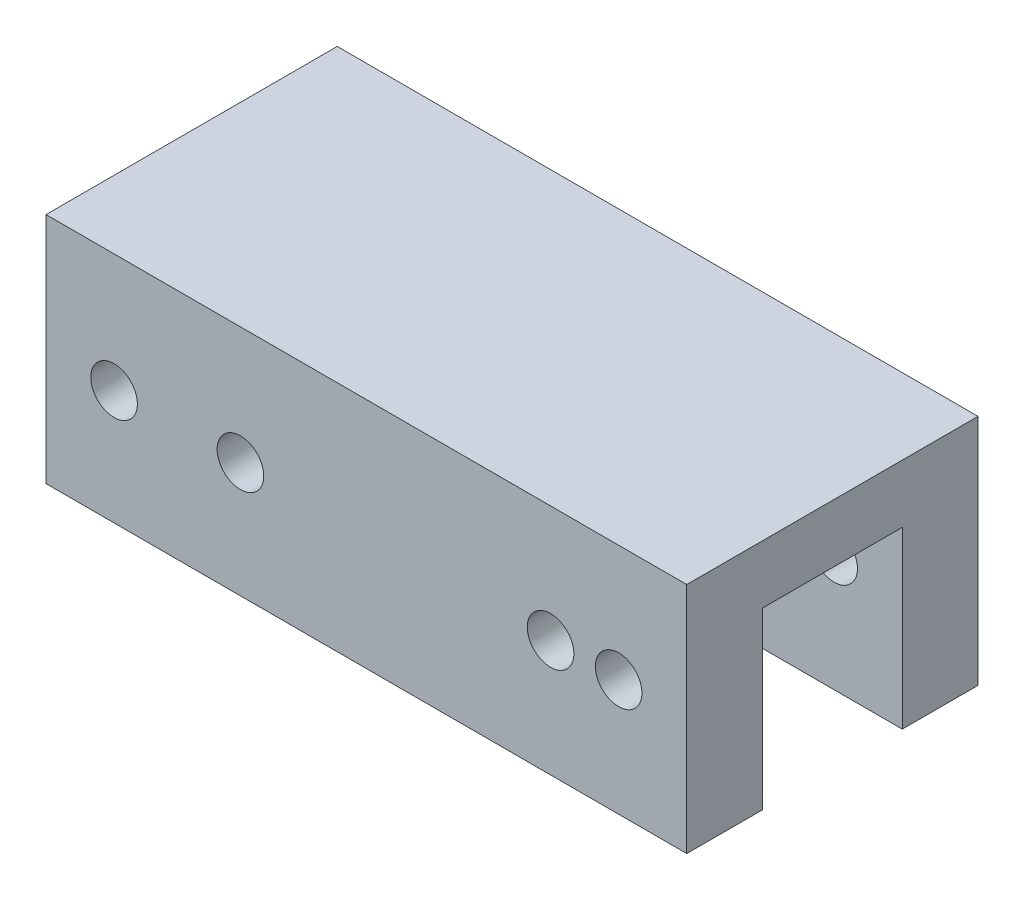
ISO-10303-21;
HEADER;
FILE_DESCRIPTION(('STEP AP214'),'2;1');
FILE_NAME('part.step','',(''),(''),'','','');
FILE_SCHEMA(('AUTOMOTIVE_DESIGN { 1 0 10303 214 1 1 1 1 }'));
ENDSEC;
DATA;
#1=APPLICATION_CONTEXT('core data for automotive mechanical design processes');
#2=APPLICATION_PROTOCOL_DEFINITION('international standard','automotive_design',2000,#1);
#3=PRODUCT_CONTEXT('',#1,'mechanical');
#4=PRODUCT('Part','Part','',(#3));
#5=PRODUCT_RELATED_PRODUCT_CATEGORY('part','',(#4));
#6=PRODUCT_DEFINITION_FORMATION('','',#4);
#7=PRODUCT_DEFINITION_CONTEXT('part definition',#1,'design');
#8=PRODUCT_DEFINITION('design','',#6,#7);
#9=PRODUCT_DEFINITION_SHAPE('','',#8);
#10=(LENGTH_UNIT() NAMED_UNIT(*) SI_UNIT(.MILLI.,.METRE.));
#11=(NAMED_UNIT(*) PLANE_ANGLE_UNIT() SI_UNIT($,.RADIAN.));
#12=(NAMED_UNIT(*) SI_UNIT($,.STERADIAN.) SOLID_ANGLE_UNIT());
#13=UNCERTAINTY_MEASURE_WITH_UNIT(LENGTH_MEASURE(1.E-05),#10,'distance_accuracy_value','');
#14=(GEOMETRIC_REPRESENTATION_CONTEXT(3) GLOBAL_UNCERTAINTY_ASSIGNED_CONTEXT((#13)) GLOBAL_UNIT_ASSIGNED_CONTEXT((#10,
#11,#12)) REPRESENTATION_CONTEXT('',''));
#15=CARTESIAN_POINT('',(0.,0.,0.));
#16=DIRECTION('',(0.,0.,1.));
#17=DIRECTION('',(1.,0.,0.));
#18=AXIS2_PLACEMENT_3D('',#15,#16,#17);
#19=CARTESIAN_POINT('',(0.,0.,0.));
#20=DIRECTION('',(0.,1.,0.));
#21=DIRECTION('',(0.,0.,1.));
#22=AXIS2_PLACEMENT_3D('',#19,#20,#21);
#23=PLANE('',#22);
#24=DIRECTION('',(0.,0.,1.));
#25=VECTOR('',#24,1.);
#26=CARTESIAN_POINT('',(-24.7741935483871,0.,8.51612903225807));
#27=LINE('',#26,#25);
#28=CARTESIAN_POINT('',(-24.7741935483871,0.,2.01612903225807));
#29=VERTEX_POINT('',#28);
#30=CARTESIAN_POINT('',(-24.7741935483871,0.,8.51612903225807));
#31=VERTEX_POINT('',#30);
#32=EDGE_CURVE('E159',#29,#31,#27,.T.);
#33=ORIENTED_EDGE('',*,*,#32,.F.);
#34=DIRECTION('',(-1.,0.,0.));
#35=VECTOR('',#34,1.);
#36=CARTESIAN_POINT('',(30.2258064516129,0.,2.01612903225807));
#37=LINE('',#36,#35);
#38=CARTESIAN_POINT('',(30.2258064516129,0.,2.01612903225807));
#39=VERTEX_POINT('',#38);
#40=EDGE_CURVE('E114',#39,#29,#37,.T.);
#41=ORIENTED_EDGE('',*,*,#40,.F.);
#42=DIRECTION('',(0.,0.,-1.));
#43=VECTOR('',#42,1.);
#44=CARTESIAN_POINT('',(30.2258064516129,0.,8.51612903225806));
#45=LINE('',#44,#43);
#46=CARTESIAN_POINT('',(30.2258064516129,0.,8.51612903225806));
#47=VERTEX_POINT('',#46);
#48=EDGE_CURVE('E154',#47,#39,#45,.T.);
#49=ORIENTED_EDGE('',*,*,#48,.F.);
#50=DIRECTION('',(1.,0.,0.));
#51=VECTOR('',#50,1.);
#52=CARTESIAN_POINT('',(30.2258064516129,0.,8.51612903225806));
#53=LINE('',#52,#51);
#54=EDGE_CURVE('E80',#31,#47,#53,.T.);
#55=ORIENTED_EDGE('',*,*,#54,.F.);
#56=EDGE_LOOP('',(#33,#41,#49,#55));
#57=FACE_BOUND('',#56,.T.);
#58=ADVANCED_FACE('F33',(#57),#23,.F.);
#59=CARTESIAN_POINT('',(30.2258064516129,20.,8.51612903225806));
#60=DIRECTION('',(-1.,0.,0.));
#61=DIRECTION('',(0.,0.,1.));
#62=AXIS2_PLACEMENT_3D('',#59,#60,#61);
#63=PLANE('',#62);
#64=ORIENTED_EDGE('',*,*,#48,.T.);
#65=DIRECTION('',(0.,-1.,0.));
#66=VECTOR('',#65,1.);
#67=CARTESIAN_POINT('',(30.2258064516129,15.,2.01612903225807));
#68=LINE('',#67,#66);
#69=CARTESIAN_POINT('',(30.2258064516129,15.,2.01612903225807));
#70=VERTEX_POINT('',#69);
#71=EDGE_CURVE('E140',#70,#39,#68,.T.);
#72=ORIENTED_EDGE('',*,*,#71,.F.);
#73=DIRECTION('',(0.,0.,1.));
#74=VECTOR('',#73,1.);
#75=CARTESIAN_POINT('',(30.2258064516129,15.,-9.98387096774193));
#76=LINE('',#75,#74);
#77=CARTESIAN_POINT('',(30.2258064516129,15.,-9.98387096774193));
#78=VERTEX_POINT('',#77);
#79=EDGE_CURVE('E118',#78,#70,#76,.T.);
#80=ORIENTED_EDGE('',*,*,#79,.F.);
#81=DIRECTION('',(0.,-1.,0.));
#82=VECTOR('',#81,1.);
#83=CARTESIAN_POINT('',(30.2258064516129,15.,-9.98387096774193));
#84=LINE('',#83,#82);
#85=CARTESIAN_POINT('',(30.2258064516129,0.,-9.98387096774193));
#86=VERTEX_POINT('',#85);
#87=EDGE_CURVE('E143',#78,#86,#84,.T.);
#88=ORIENTED_EDGE('',*,*,#87,.T.);
#89=CARTESIAN_POINT('',(30.2258064516129,0.,-16.4838709677419));
#90=VERTEX_POINT('',#89);
#91=EDGE_CURVE('E142',#86,#90,#45,.T.);
#92=ORIENTED_EDGE('',*,*,#91,.T.);
#93=DIRECTION('',(0.,-1.,0.));
#94=VECTOR('',#93,1.);
#95=CARTESIAN_POINT('',(30.2258064516129,20.,-16.4838709677419));
#96=LINE('',#95,#94);
#97=CARTESIAN_POINT('',(30.2258064516129,20.,-16.4838709677419));
#98=VERTEX_POINT('',#97);
#99=EDGE_CURVE('E11',#98,#90,#96,.T.);
#100=ORIENTED_EDGE('',*,*,#99,.F.);
#101=DIRECTION('',(0.,0.,-1.));
#102=VECTOR('',#101,1.);
#103=CARTESIAN_POINT('',(30.2258064516129,20.,8.51612903225806));
#104=LINE('',#103,#102);
#105=CARTESIAN_POINT('',(30.2258064516129,20.,8.51612903225806));
#106=VERTEX_POINT('',#105);
#107=EDGE_CURVE('E147',#106,#98,#104,.T.);
#108=ORIENTED_EDGE('',*,*,#107,.F.);
#109=DIRECTION('',(0.,-1.,0.));
#110=VECTOR('',#109,1.);
#111=CARTESIAN_POINT('',(30.2258064516129,20.,8.51612903225806));
#112=LINE('',#111,#110);
#113=EDGE_CURVE('E153',#106,#47,#112,.T.);
#114=ORIENTED_EDGE('',*,*,#113,.T.);
#115=EDGE_LOOP('',(#64,#72,#80,#88,#92,#100,#108,#114));
#116=FACE_BOUND('',#115,.T.);
#117=ADVANCED_FACE('F35',(#116),#63,.F.);
#118=CARTESIAN_POINT('',(30.2258064516129,20.,-16.4838709677419));
#119=DIRECTION('',(0.,0.,1.));
#120=DIRECTION('',(1.,0.,0.));
#121=AXIS2_PLACEMENT_3D('',#118,#119,#120);
#122=PLANE('',#121);
#123=CARTESIAN_POINT('',(-18.9291935483871,9.83881896170148,-16.4838709677419));
#124=DIRECTION('',(0.,0.,-1.));
#125=DIRECTION('',(-1.,0.,0.));
#126=AXIS2_PLACEMENT_3D('',#123,#124,#125);
#127=CIRCLE('',#126,2.);
#128=CARTESIAN_POINT('',(-20.9291935483871,9.83881896170148,-16.4838709677419));
#129=VERTEX_POINT('',#128);
#130=EDGE_CURVE('E316',#129,#129,#127,.T.);
#131=ORIENTED_EDGE('',*,*,#130,.F.);
#132=EDGE_LOOP('',(#131));
#133=FACE_BOUND('',#132,.T.);
#134=CARTESIAN_POINT('',(-8.08419354838709,9.90361755901248,-16.4838709677419));
#135=DIRECTION('',(0.,0.,-1.));
#136=DIRECTION('',(-1.,0.,0.));
#137=AXIS2_PLACEMENT_3D('',#134,#135,#136);
#138=CIRCLE('',#137,2.);
#139=CARTESIAN_POINT('',(-10.0841935483871,9.90361755901248,-16.4838709677419));
#140=VERTEX_POINT('',#139);
#141=EDGE_CURVE('E180',#140,#140,#138,.T.);
#142=ORIENTED_EDGE('',*,*,#141,.F.);
#143=EDGE_LOOP('',(#142));
#144=FACE_BOUND('',#143,.T.);
#145=CARTESIAN_POINT('',(18.5358064516129,10.,-16.4838709677419));
#146=DIRECTION('',(0.,0.,1.));
#147=DIRECTION('',(1.,0.,0.));
#148=AXIS2_PLACEMENT_3D('',#145,#146,#147);
#149=CIRCLE('',#148,2.);
#150=CARTESIAN_POINT('',(20.5358064516129,10.,-16.4838709677419));
#151=VERTEX_POINT('',#150);
#152=EDGE_CURVE('E202',#151,#151,#149,.T.);
#153=ORIENTED_EDGE('',*,*,#152,.T.);
#154=EDGE_LOOP('',(#153));
#155=FACE_BOUND('',#154,.T.);
#156=CARTESIAN_POINT('',(24.3808064516129,10.,-16.4838709677419));
#157=DIRECTION('',(0.,0.,1.));
#158=DIRECTION('',(1.,0.,0.));
#159=AXIS2_PLACEMENT_3D('',#156,#157,#158);
#160=CIRCLE('',#159,2.);
#161=CARTESIAN_POINT('',(26.3808064516129,10.,-16.4838709677419));
#162=VERTEX_POINT('',#161);
#163=EDGE_CURVE('E138',#162,#162,#160,.T.);
#164=ORIENTED_EDGE('',*,*,#163,.T.);
#165=EDGE_LOOP('',(#164));
#166=FACE_BOUND('',#165,.T.);
#167=DIRECTION('',(-1.,0.,0.));
#168=VECTOR('',#167,1.);
#169=CARTESIAN_POINT('',(30.2258064516129,0.,-16.4838709677419));
#170=LINE('',#169,#168);
#171=CARTESIAN_POINT('',(-24.7741935483871,0.,-16.4838709677419));
#172=VERTEX_POINT('',#171);
#173=EDGE_CURVE('E157',#90,#172,#170,.T.);
#174=ORIENTED_EDGE('',*,*,#173,.T.);
#175=DIRECTION('',(0.,-1.,0.));
#176=VECTOR('',#175,1.);
#177=CARTESIAN_POINT('',(-24.7741935483871,20.,-16.4838709677419));
#178=LINE('',#177,#176);
#179=CARTESIAN_POINT('',(-24.7741935483871,20.,-16.4838709677419));
#180=VERTEX_POINT('',#179);
#181=EDGE_CURVE('E42',#180,#172,#178,.T.);
#182=ORIENTED_EDGE('',*,*,#181,.F.);
#183=DIRECTION('',(-1.,0.,0.));
#184=VECTOR('',#183,1.);
#185=CARTESIAN_POINT('',(30.2258064516129,20.,-16.4838709677419));
#186=LINE('',#185,#184);
#187=EDGE_CURVE('E87',#98,#180,#186,.T.);
#188=ORIENTED_EDGE('',*,*,#187,.F.);
#189=ORIENTED_EDGE('',*,*,#99,.T.);
#190=EDGE_LOOP('',(#174,#182,#188,#189));
#191=FACE_BOUND('',#190,.T.);
#192=ADVANCED_FACE('F211',(#133,#144,#155,#166,#191),#122,.F.);
#193=CARTESIAN_POINT('',(-24.7741935483871,20.,8.51612903225807));
#194=DIRECTION('',(1.,0.,0.));
#195=DIRECTION('',(0.,0.,-1.));
#196=AXIS2_PLACEMENT_3D('',#193,#194,#195);
#197=PLANE('',#196);
#198=DIRECTION('',(0.,0.,-1.));
#199=VECTOR('',#198,1.);
#200=CARTESIAN_POINT('',(-24.7741935483871,15.,2.01612903225807));
#201=LINE('',#200,#199);
#202=CARTESIAN_POINT('',(-24.7741935483871,15.,2.01612903225807));
#203=VERTEX_POINT('',#202);
#204=CARTESIAN_POINT('',(-24.7741935483871,15.,-9.98387096774194));
#205=VERTEX_POINT('',#204);
#206=EDGE_CURVE('E124',#203,#205,#201,.T.);
#207=ORIENTED_EDGE('',*,*,#206,.F.);
#208=DIRECTION('',(0.,-1.,0.));
#209=VECTOR('',#208,1.);
#210=CARTESIAN_POINT('',(-24.7741935483871,15.,2.01612903225807));
#211=LINE('',#210,#209);
#212=EDGE_CURVE('E108',#203,#29,#211,.T.);
#213=ORIENTED_EDGE('',*,*,#212,.T.);
#214=ORIENTED_EDGE('',*,*,#32,.T.);
#215=DIRECTION('',(0.,-1.,0.));
#216=VECTOR('',#215,1.);
#217=CARTESIAN_POINT('',(-24.7741935483871,20.,8.51612903225807));
#218=LINE('',#217,#216);
#219=CARTESIAN_POINT('',(-24.7741935483871,20.,8.51612903225807));
#220=VERTEX_POINT('',#219);
#221=EDGE_CURVE('E164',#220,#31,#218,.T.);
#222=ORIENTED_EDGE('',*,*,#221,.F.);
#223=DIRECTION('',(0.,0.,1.));
#224=VECTOR('',#223,1.);
#225=CARTESIAN_POINT('',(-24.7741935483871,20.,8.51612903225807));
#226=LINE('',#225,#224);
#227=EDGE_CURVE('E150',#180,#220,#226,.T.);
#228=ORIENTED_EDGE('',*,*,#227,.F.);
#229=ORIENTED_EDGE('',*,*,#181,.T.);
#230=CARTESIAN_POINT('',(-24.7741935483871,0.,-9.98387096774194));
#231=VERTEX_POINT('',#230);
#232=EDGE_CURVE('E160',#172,#231,#27,.T.);
#233=ORIENTED_EDGE('',*,*,#232,.T.);
#234=DIRECTION('',(0.,-1.,0.));
#235=VECTOR('',#234,1.);
#236=CARTESIAN_POINT('',(-24.7741935483871,15.,-9.98387096774194));
#237=LINE('',#236,#235);
#238=EDGE_CURVE('E50',#205,#231,#237,.T.);
#239=ORIENTED_EDGE('',*,*,#238,.F.);
#240=EDGE_LOOP('',(#207,#213,#214,#222,#228,#229,#233,#239));
#241=FACE_BOUND('',#240,.T.);
#242=ADVANCED_FACE('F129',(#241),#197,.F.);
#243=CARTESIAN_POINT('',(30.2258064516129,20.,8.51612903225806));
#244=DIRECTION('',(0.,0.,-1.));
#245=DIRECTION('',(-1.,0.,0.));
#246=AXIS2_PLACEMENT_3D('',#243,#244,#245);
#247=PLANE('',#246);
#248=CARTESIAN_POINT('',(-18.9291935483871,9.83881896170148,8.51612903225807));
#249=DIRECTION('',(0.,0.,-1.));
#250=DIRECTION('',(-1.,0.,0.));
#251=AXIS2_PLACEMENT_3D('',#248,#249,#250);
#252=CIRCLE('',#251,2.);
#253=CARTESIAN_POINT('',(-20.9291935483871,9.83881896170148,8.51612903225807));
#254=VERTEX_POINT('',#253);
#255=EDGE_CURVE('E187',#254,#254,#252,.T.);
#256=ORIENTED_EDGE('',*,*,#255,.T.);
#257=EDGE_LOOP('',(#256));
#258=FACE_BOUND('',#257,.T.);
#259=CARTESIAN_POINT('',(-8.08419354838709,9.90361755901248,8.51612903225806));
#260=DIRECTION('',(0.,0.,-1.));
#261=DIRECTION('',(-1.,0.,0.));
#262=AXIS2_PLACEMENT_3D('',#259,#260,#261);
#263=CIRCLE('',#262,2.);
#264=CARTESIAN_POINT('',(-10.0841935483871,9.90361755901248,8.51612903225806));
#265=VERTEX_POINT('',#264);
#266=EDGE_CURVE('E184',#265,#265,#263,.T.);
#267=ORIENTED_EDGE('',*,*,#266,.T.);
#268=EDGE_LOOP('',(#267));
#269=FACE_BOUND('',#268,.T.);
#270=CARTESIAN_POINT('',(18.5358064516129,10.,8.51612903225807));
#271=DIRECTION('',(0.,0.,-1.));
#272=DIRECTION('',(-1.,0.,0.));
#273=AXIS2_PLACEMENT_3D('',#270,#271,#272);
#274=CIRCLE('',#273,2.);
#275=CARTESIAN_POINT('',(16.5358064516129,10.,8.51612903225807));
#276=VERTEX_POINT('',#275);
#277=EDGE_CURVE('E176',#276,#276,#274,.T.);
#278=ORIENTED_EDGE('',*,*,#277,.T.);
#279=EDGE_LOOP('',(#278));
#280=FACE_BOUND('',#279,.T.);
#281=CARTESIAN_POINT('',(24.3808064516129,10.,8.51612903225807));
#282=DIRECTION('',(0.,0.,-1.));
#283=DIRECTION('',(-1.,0.,0.));
#284=AXIS2_PLACEMENT_3D('',#281,#282,#283);
#285=CIRCLE('',#284,2.);
#286=CARTESIAN_POINT('',(22.3808064516129,10.,8.51612903225807));
#287=VERTEX_POINT('',#286);
#288=EDGE_CURVE('E172',#287,#287,#285,.T.);
#289=ORIENTED_EDGE('',*,*,#288,.T.);
#290=EDGE_LOOP('',(#289));
#291=FACE_BOUND('',#290,.T.);
#292=ORIENTED_EDGE('',*,*,#54,.T.);
#293=ORIENTED_EDGE('',*,*,#113,.F.);
#294=DIRECTION('',(1.,0.,0.));
#295=VECTOR('',#294,1.);
#296=CARTESIAN_POINT('',(30.2258064516129,20.,8.51612903225806));
#297=LINE('',#296,#295);
#298=EDGE_CURVE('E59',#220,#106,#297,.T.);
#299=ORIENTED_EDGE('',*,*,#298,.F.);
#300=ORIENTED_EDGE('',*,*,#221,.T.);
#301=EDGE_LOOP('',(#292,#293,#299,#300));
#302=FACE_BOUND('',#301,.T.);
#303=ADVANCED_FACE('F247',(#258,#269,#280,#291,#302),#247,.F.);
#304=CARTESIAN_POINT('',(0.,20.,0.));
#305=DIRECTION('',(0.,1.,0.));
#306=DIRECTION('',(0.,0.,1.));
#307=AXIS2_PLACEMENT_3D('',#304,#305,#306);
#308=PLANE('',#307);
#309=ORIENTED_EDGE('',*,*,#107,.T.);
#310=ORIENTED_EDGE('',*,*,#187,.T.);
#311=ORIENTED_EDGE('',*,*,#227,.T.);
#312=ORIENTED_EDGE('',*,*,#298,.T.);
#313=EDGE_LOOP('',(#309,#310,#311,#312));
#314=FACE_BOUND('',#313,.T.);
#315=ADVANCED_FACE('F239',(#314),#308,.T.);
#316=ORIENTED_EDGE('',*,*,#91,.F.);
#317=DIRECTION('',(1.,0.,0.));
#318=VECTOR('',#317,1.);
#319=CARTESIAN_POINT('',(-24.7741935483871,0.,-9.98387096774194));
#320=LINE('',#319,#318);
#321=EDGE_CURVE('E127',#231,#86,#320,.T.);
#322=ORIENTED_EDGE('',*,*,#321,.F.);
#323=ORIENTED_EDGE('',*,*,#232,.F.);
#324=ORIENTED_EDGE('',*,*,#173,.F.);
#325=EDGE_LOOP('',(#316,#322,#323,#324));
#326=FACE_BOUND('',#325,.T.);
#327=ADVANCED_FACE('F231',(#326),#23,.F.);
#328=CARTESIAN_POINT('',(30.2258064516129,15.,2.01612903225807));
#329=DIRECTION('',(0.,0.,1.));
#330=DIRECTION('',(1.,0.,0.));
#331=AXIS2_PLACEMENT_3D('',#328,#329,#330);
#332=PLANE('',#331);
#333=CARTESIAN_POINT('',(-18.9291935483871,9.83881896170148,2.01612903225807));
#334=DIRECTION('',(0.,0.,1.));
#335=DIRECTION('',(1.,0.,0.));
#336=AXIS2_PLACEMENT_3D('',#333,#334,#335);
#337=CIRCLE('',#336,2.);
#338=CARTESIAN_POINT('',(-16.9291935483871,9.83881896170148,2.01612903225807));
#339=VERTEX_POINT('',#338);
#340=EDGE_CURVE('E192',#339,#339,#337,.T.);
#341=ORIENTED_EDGE('',*,*,#340,.T.);
#342=EDGE_LOOP('',(#341));
#343=FACE_BOUND('',#342,.T.);
#344=CARTESIAN_POINT('',(-8.08419354838709,9.90361755901248,2.01612903225807));
#345=DIRECTION('',(0.,0.,1.));
#346=DIRECTION('',(1.,0.,0.));
#347=AXIS2_PLACEMENT_3D('',#344,#345,#346);
#348=CIRCLE('',#347,2.);
#349=CARTESIAN_POINT('',(-6.08419354838709,9.90361755901248,2.01612903225807));
#350=VERTEX_POINT('',#349);
#351=EDGE_CURVE('E179',#350,#350,#348,.T.);
#352=ORIENTED_EDGE('',*,*,#351,.T.);
#353=EDGE_LOOP('',(#352));
#354=FACE_BOUND('',#353,.T.);
#355=CARTESIAN_POINT('',(18.5358064516129,10.,2.01612903225807));
#356=DIRECTION('',(0.,0.,1.));
#357=DIRECTION('',(1.,0.,0.));
#358=AXIS2_PLACEMENT_3D('',#355,#356,#357);
#359=CIRCLE('',#358,2.);
#360=CARTESIAN_POINT('',(20.5358064516129,10.,2.01612903225807));
#361=VERTEX_POINT('',#360);
#362=EDGE_CURVE('E175',#361,#361,#359,.T.);
#363=ORIENTED_EDGE('',*,*,#362,.T.);
#364=EDGE_LOOP('',(#363));
#365=FACE_BOUND('',#364,.T.);
#366=CARTESIAN_POINT('',(24.3808064516129,10.,2.01612903225807));
#367=DIRECTION('',(0.,0.,1.));
#368=DIRECTION('',(1.,0.,0.));
#369=AXIS2_PLACEMENT_3D('',#366,#367,#368);
#370=CIRCLE('',#369,2.);
#371=CARTESIAN_POINT('',(26.3808064516129,10.,2.01612903225807));
#372=VERTEX_POINT('',#371);
#373=EDGE_CURVE('E171',#372,#372,#370,.T.);
#374=ORIENTED_EDGE('',*,*,#373,.T.);
#375=EDGE_LOOP('',(#374));
#376=FACE_BOUND('',#375,.T.);
#377=ORIENTED_EDGE('',*,*,#40,.T.);
#378=ORIENTED_EDGE('',*,*,#212,.F.);
#379=DIRECTION('',(-1.,0.,0.));
#380=VECTOR('',#379,1.);
#381=CARTESIAN_POINT('',(30.2258064516129,15.,2.01612903225807));
#382=LINE('',#381,#380);
#383=EDGE_CURVE('E111',#70,#203,#382,.T.);
#384=ORIENTED_EDGE('',*,*,#383,.F.);
#385=ORIENTED_EDGE('',*,*,#71,.T.);
#386=EDGE_LOOP('',(#377,#378,#384,#385));
#387=FACE_BOUND('',#386,.T.);
#388=ADVANCED_FACE('F110',(#343,#354,#365,#376,#387),#332,.F.);
#389=CARTESIAN_POINT('',(-24.7741935483871,15.,-9.98387096774194));
#390=DIRECTION('',(0.,0.,-1.));
#391=DIRECTION('',(-1.,0.,0.));
#392=AXIS2_PLACEMENT_3D('',#389,#390,#391);
#393=PLANE('',#392);
#394=CARTESIAN_POINT('',(-18.9291935483871,9.83881896170148,-9.98387096774194));
#395=DIRECTION('',(0.,0.,-1.));
#396=DIRECTION('',(-1.,0.,0.));
#397=AXIS2_PLACEMENT_3D('',#394,#395,#396);
#398=CIRCLE('',#397,2.);
#399=CARTESIAN_POINT('',(-20.9291935483871,9.83881896170148,-9.98387096774194));
#400=VERTEX_POINT('',#399);
#401=EDGE_CURVE('E37',#400,#400,#398,.T.);
#402=ORIENTED_EDGE('',*,*,#401,.T.);
#403=EDGE_LOOP('',(#402));
#404=FACE_BOUND('',#403,.T.);
#405=CARTESIAN_POINT('',(-8.08419354838709,9.90361755901248,-9.98387096774193));
#406=DIRECTION('',(0.,0.,-1.));
#407=DIRECTION('',(-1.,0.,0.));
#408=AXIS2_PLACEMENT_3D('',#405,#406,#407);
#409=CIRCLE('',#408,2.);
#410=CARTESIAN_POINT('',(-10.0841935483871,9.90361755901248,-9.98387096774193));
#411=VERTEX_POINT('',#410);
#412=EDGE_CURVE('E177',#411,#411,#409,.T.);
#413=ORIENTED_EDGE('',*,*,#412,.T.);
#414=EDGE_LOOP('',(#413));
#415=FACE_BOUND('',#414,.T.);
#416=CARTESIAN_POINT('',(18.5358064516129,10.,-9.98387096774193));
#417=DIRECTION('',(0.,0.,-1.));
#418=DIRECTION('',(-1.,0.,0.));
#419=AXIS2_PLACEMENT_3D('',#416,#417,#418);
#420=CIRCLE('',#419,2.);
#421=CARTESIAN_POINT('',(16.5358064516129,10.,-9.98387096774193));
#422=VERTEX_POINT('',#421);
#423=EDGE_CURVE('E173',#422,#422,#420,.T.);
#424=ORIENTED_EDGE('',*,*,#423,.T.);
#425=EDGE_LOOP('',(#424));
#426=FACE_BOUND('',#425,.T.);
#427=CARTESIAN_POINT('',(24.3808064516129,10.,-9.98387096774193));
#428=DIRECTION('',(0.,0.,-1.));
#429=DIRECTION('',(-1.,0.,0.));
#430=AXIS2_PLACEMENT_3D('',#427,#428,#429);
#431=CIRCLE('',#430,2.);
#432=CARTESIAN_POINT('',(22.3808064516129,10.,-9.98387096774193));
#433=VERTEX_POINT('',#432);
#434=EDGE_CURVE('E168',#433,#433,#431,.T.);
#435=ORIENTED_EDGE('',*,*,#434,.T.);
#436=EDGE_LOOP('',(#435));
#437=FACE_BOUND('',#436,.T.);
#438=ORIENTED_EDGE('',*,*,#321,.T.);
#439=ORIENTED_EDGE('',*,*,#87,.F.);
#440=DIRECTION('',(1.,0.,0.));
#441=VECTOR('',#440,1.);
#442=CARTESIAN_POINT('',(-24.7741935483871,15.,-9.98387096774194));
#443=LINE('',#442,#441);
#444=EDGE_CURVE('E131',#205,#78,#443,.T.);
#445=ORIENTED_EDGE('',*,*,#444,.F.);
#446=ORIENTED_EDGE('',*,*,#238,.T.);
#447=EDGE_LOOP('',(#438,#439,#445,#446));
#448=FACE_BOUND('',#447,.T.);
#449=ADVANCED_FACE('F224',(#404,#415,#426,#437,#448),#393,.F.);
#450=CARTESIAN_POINT('',(0.,15.,0.));
#451=DIRECTION('',(0.,-1.,0.));
#452=DIRECTION('',(0.,0.,-1.));
#453=AXIS2_PLACEMENT_3D('',#450,#451,#452);
#454=PLANE('',#453);
#455=ORIENTED_EDGE('',*,*,#383,.T.);
#456=ORIENTED_EDGE('',*,*,#206,.T.);
#457=ORIENTED_EDGE('',*,*,#444,.T.);
#458=ORIENTED_EDGE('',*,*,#79,.T.);
#459=EDGE_LOOP('',(#455,#456,#457,#458));
#460=FACE_BOUND('',#459,.T.);
#461=ADVANCED_FACE('F122',(#460),#454,.T.);
#462=CARTESIAN_POINT('',(24.3808064516129,10.,8.51612903225807));
#463=DIRECTION('',(0.,0.,-1.));
#464=DIRECTION('',(-1.,0.,0.));
#465=AXIS2_PLACEMENT_3D('',#462,#463,#464);
#466=CYLINDRICAL_SURFACE('',#465,2.);
#467=ORIENTED_EDGE('',*,*,#434,.F.);
#468=EDGE_LOOP('',(#467));
#469=FACE_BOUND('',#468,.T.);
#470=ORIENTED_EDGE('',*,*,#163,.F.);
#471=EDGE_LOOP('',(#470));
#472=FACE_BOUND('',#471,.T.);
#473=ADVANCED_FACE('F213',(#469,#472),#466,.F.);
#474=ORIENTED_EDGE('',*,*,#288,.F.);
#475=EDGE_LOOP('',(#474));
#476=FACE_BOUND('',#475,.T.);
#477=ORIENTED_EDGE('',*,*,#373,.F.);
#478=EDGE_LOOP('',(#477));
#479=FACE_BOUND('',#478,.T.);
#480=ADVANCED_FACE('F215',(#476,#479),#466,.F.);
#481=CARTESIAN_POINT('',(18.5358064516129,10.,8.51612903225807));
#482=DIRECTION('',(0.,0.,-1.));
#483=DIRECTION('',(-1.,0.,0.));
#484=AXIS2_PLACEMENT_3D('',#481,#482,#483);
#485=CYLINDRICAL_SURFACE('',#484,2.);
#486=ORIENTED_EDGE('',*,*,#423,.F.);
#487=EDGE_LOOP('',(#486));
#488=FACE_BOUND('',#487,.T.);
#489=ORIENTED_EDGE('',*,*,#152,.F.);
#490=EDGE_LOOP('',(#489));
#491=FACE_BOUND('',#490,.T.);
#492=ADVANCED_FACE('F222',(#488,#491),#485,.F.);
#493=ORIENTED_EDGE('',*,*,#277,.F.);
#494=EDGE_LOOP('',(#493));
#495=FACE_BOUND('',#494,.T.);
#496=ORIENTED_EDGE('',*,*,#362,.F.);
#497=EDGE_LOOP('',(#496));
#498=FACE_BOUND('',#497,.T.);
#499=ADVANCED_FACE('F266',(#495,#498),#485,.F.);
#500=CARTESIAN_POINT('',(-8.08419354838709,9.90361755901248,18.5161290322581));
#501=DIRECTION('',(0.,0.,-1.));
#502=DIRECTION('',(-1.,0.,0.));
#503=AXIS2_PLACEMENT_3D('',#500,#501,#502);
#504=CYLINDRICAL_SURFACE('',#503,2.);
#505=ORIENTED_EDGE('',*,*,#141,.T.);
#506=EDGE_LOOP('',(#505));
#507=FACE_BOUND('',#506,.T.);
#508=ORIENTED_EDGE('',*,*,#412,.F.);
#509=EDGE_LOOP('',(#508));
#510=FACE_BOUND('',#509,.T.);
#511=ADVANCED_FACE('F294',(#507,#510),#504,.F.);
#512=ORIENTED_EDGE('',*,*,#351,.F.);
#513=EDGE_LOOP('',(#512));
#514=FACE_BOUND('',#513,.T.);
#515=ORIENTED_EDGE('',*,*,#266,.F.);
#516=EDGE_LOOP('',(#515));
#517=FACE_BOUND('',#516,.T.);
#518=ADVANCED_FACE('F300',(#514,#517),#504,.F.);
#519=CARTESIAN_POINT('',(-18.9291935483871,9.83881896170148,18.5161290322581));
#520=DIRECTION('',(0.,0.,-1.));
#521=DIRECTION('',(-1.,0.,0.));
#522=AXIS2_PLACEMENT_3D('',#519,#520,#521);
#523=CYLINDRICAL_SURFACE('',#522,2.);
#524=ORIENTED_EDGE('',*,*,#130,.T.);
#525=EDGE_LOOP('',(#524));
#526=FACE_BOUND('',#525,.T.);
#527=ORIENTED_EDGE('',*,*,#401,.F.);
#528=EDGE_LOOP('',(#527));
#529=FACE_BOUND('',#528,.T.);
#530=ADVANCED_FACE('F304',(#526,#529),#523,.F.);
#531=ORIENTED_EDGE('',*,*,#340,.F.);
#532=EDGE_LOOP('',(#531));
#533=FACE_BOUND('',#532,.T.);
#534=ORIENTED_EDGE('',*,*,#255,.F.);
#535=EDGE_LOOP('',(#534));
#536=FACE_BOUND('',#535,.T.);
#537=ADVANCED_FACE('F306',(#533,#536),#523,.F.);
#538=CLOSED_SHELL('',(#58,#117,#192,#242,#303,#315,#327,#388,#449,#461,#473,#480,#492,#499,#511,
#518,#530,#537));
#539=MANIFOLD_SOLID_BREP('B2',#538);
#540=ADVANCED_BREP_SHAPE_REPRESENTATION('',(#18,#539),#14);
#541=SHAPE_DEFINITION_REPRESENTATION(#9,#540);
ENDSEC;
END-ISO-10303-21;
